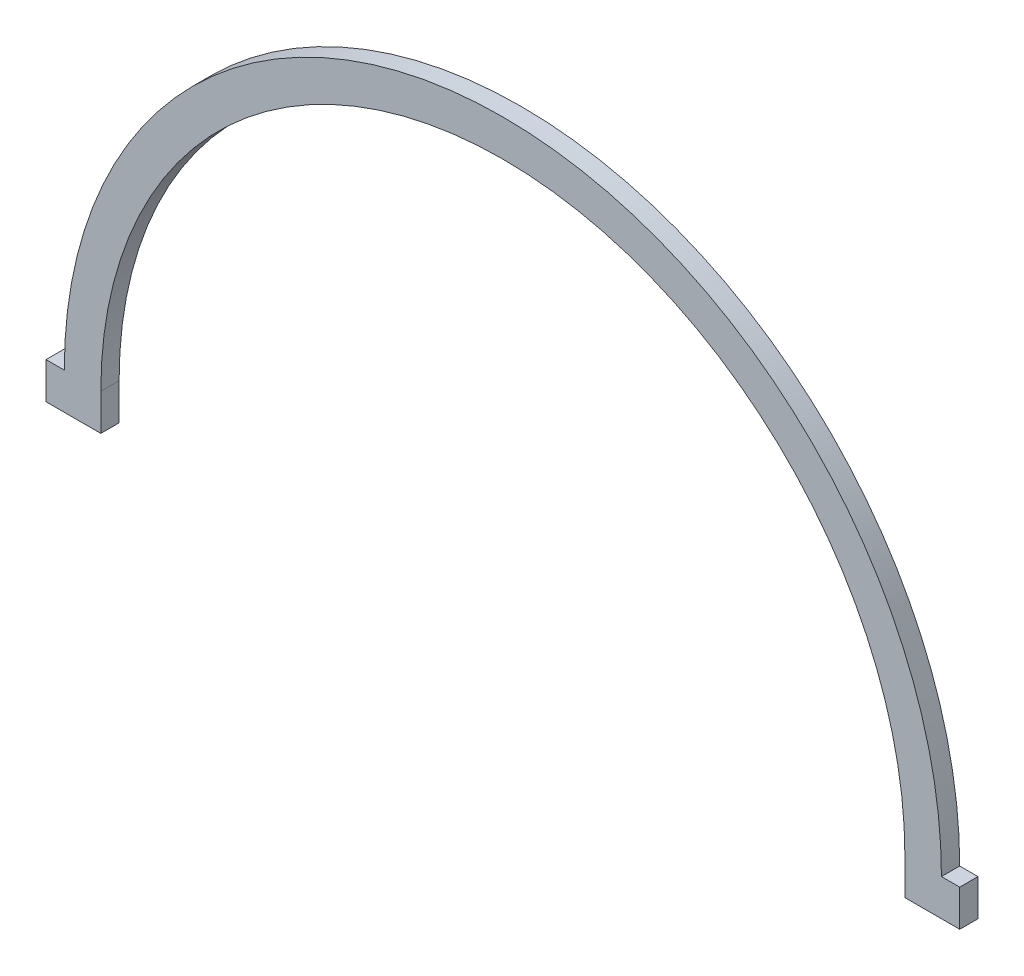
ISO-10303-21;
HEADER;
FILE_DESCRIPTION(('STEP AP214'),'2;1');
FILE_NAME('part.step','',(''),(''),'','','');
FILE_SCHEMA(('AUTOMOTIVE_DESIGN { 1 0 10303 214 1 1 1 1 }'));
ENDSEC;
DATA;
#1=APPLICATION_CONTEXT('core data for automotive mechanical design processes');
#2=APPLICATION_PROTOCOL_DEFINITION('international standard','automotive_design',2000,#1);
#3=PRODUCT_CONTEXT('',#1,'mechanical');
#4=PRODUCT('Part','Part','',(#3));
#5=PRODUCT_RELATED_PRODUCT_CATEGORY('part','',(#4));
#6=PRODUCT_DEFINITION_FORMATION('','',#4);
#7=PRODUCT_DEFINITION_CONTEXT('part definition',#1,'design');
#8=PRODUCT_DEFINITION('design','',#6,#7);
#9=PRODUCT_DEFINITION_SHAPE('','',#8);
#10=(LENGTH_UNIT() NAMED_UNIT(*) SI_UNIT(.MILLI.,.METRE.));
#11=(NAMED_UNIT(*) PLANE_ANGLE_UNIT() SI_UNIT($,.RADIAN.));
#12=(NAMED_UNIT(*) SI_UNIT($,.STERADIAN.) SOLID_ANGLE_UNIT());
#13=UNCERTAINTY_MEASURE_WITH_UNIT(LENGTH_MEASURE(1.E-05),#10,'distance_accuracy_value','');
#14=(GEOMETRIC_REPRESENTATION_CONTEXT(3) GLOBAL_UNCERTAINTY_ASSIGNED_CONTEXT((#13)) GLOBAL_UNIT_ASSIGNED_CONTEXT((#10,
#11,#12)) REPRESENTATION_CONTEXT('',''));
#15=CARTESIAN_POINT('',(0.,0.,0.));
#16=DIRECTION('',(0.,0.,1.));
#17=DIRECTION('',(1.,0.,0.));
#18=AXIS2_PLACEMENT_3D('',#15,#16,#17);
#19=CARTESIAN_POINT('',(-79.375,-6.34999999999999,3.175));
#20=DIRECTION('',(0.,1.,0.));
#21=DIRECTION('',(-1.,0.,0.));
#22=AXIS2_PLACEMENT_3D('',#19,#20,#21);
#23=PLANE('',#22);
#24=DIRECTION('',(1.,0.,0.));
#25=VECTOR('',#24,1.);
#26=CARTESIAN_POINT('',(-79.375,-6.34999999999999,0.));
#27=LINE('',#26,#25);
#28=CARTESIAN_POINT('',(-79.375,-6.34999999999999,0.));
#29=VERTEX_POINT('',#28);
#30=CARTESIAN_POINT('',(-69.85,-6.35000000000001,0.));
#31=VERTEX_POINT('',#30);
#32=EDGE_CURVE('E139',#29,#31,#27,.T.);
#33=ORIENTED_EDGE('',*,*,#32,.T.);
#34=DIRECTION('',(0.,0.,1.));
#35=VECTOR('',#34,1.);
#36=CARTESIAN_POINT('',(-69.85,-6.35000000000001,0.));
#37=LINE('',#36,#35);
#38=CARTESIAN_POINT('',(-69.85,-6.35000000000001,3.175));
#39=VERTEX_POINT('',#38);
#40=EDGE_CURVE('E122',#31,#39,#37,.T.);
#41=ORIENTED_EDGE('',*,*,#40,.T.);
#42=DIRECTION('',(1.,0.,0.));
#43=VECTOR('',#42,1.);
#44=CARTESIAN_POINT('',(-79.375,-6.34999999999999,3.175));
#45=LINE('',#44,#43);
#46=CARTESIAN_POINT('',(-79.375,-6.34999999999999,3.175));
#47=VERTEX_POINT('',#46);
#48=EDGE_CURVE('E183',#47,#39,#45,.T.);
#49=ORIENTED_EDGE('',*,*,#48,.F.);
#50=DIRECTION('',(0.,0.,-1.));
#51=VECTOR('',#50,1.);
#52=CARTESIAN_POINT('',(-79.375,-6.34999999999999,3.175));
#53=LINE('',#52,#51);
#54=EDGE_CURVE('E144',#47,#29,#53,.T.);
#55=ORIENTED_EDGE('',*,*,#54,.T.);
#56=EDGE_LOOP('',(#33,#41,#49,#55));
#57=FACE_BOUND('',#56,.T.);
#58=ADVANCED_FACE('F38',(#57),#23,.F.);
#59=CARTESIAN_POINT('',(0.,0.,3.175));
#60=DIRECTION('',(0.,0.,1.));
#61=DIRECTION('',(1.,0.,0.));
#62=AXIS2_PLACEMENT_3D('',#59,#60,#61);
#63=PLANE('',#62);
#64=DIRECTION('',(0.,-1.,0.));
#65=VECTOR('',#64,1.);
#66=CARTESIAN_POINT('',(-69.85,-4.87759943036386E-13,3.175));
#67=LINE('',#66,#65);
#68=CARTESIAN_POINT('',(-69.85,-4.87759943036386E-13,3.175));
#69=VERTEX_POINT('',#68);
#70=EDGE_CURVE('E128',#69,#39,#67,.T.);
#71=ORIENTED_EDGE('',*,*,#70,.F.);
#72=CARTESIAN_POINT('',(0.,0.,3.175));
#73=DIRECTION('',(0.,0.,1.));
#74=DIRECTION('',(1.,0.,0.));
#75=AXIS2_PLACEMENT_3D('',#72,#73,#74);
#76=CIRCLE('',#75,69.85);
#77=CARTESIAN_POINT('',(69.85,0.,3.175));
#78=VERTEX_POINT('',#77);
#79=EDGE_CURVE('E197',#78,#69,#76,.T.);
#80=ORIENTED_EDGE('',*,*,#79,.F.);
#81=DIRECTION('',(1.,0.,0.));
#82=VECTOR('',#81,1.);
#83=CARTESIAN_POINT('',(-69.85,0.,3.175));
#84=LINE('',#83,#82);
#85=CARTESIAN_POINT('',(69.8324231282597,0.,3.175));
#86=VERTEX_POINT('',#85);
#87=EDGE_CURVE('E195',#86,#78,#84,.T.);
#88=ORIENTED_EDGE('',*,*,#87,.F.);
#89=DIRECTION('',(0.,1.,0.));
#90=VECTOR('',#89,1.);
#91=CARTESIAN_POINT('',(69.8324231282597,-4.87759943036386E-13,3.175));
#92=LINE('',#91,#90);
#93=CARTESIAN_POINT('',(69.8324231282597,-6.35000000000001,3.175));
#94=VERTEX_POINT('',#93);
#95=EDGE_CURVE('E53',#94,#86,#92,.T.);
#96=ORIENTED_EDGE('',*,*,#95,.F.);
#97=CARTESIAN_POINT('',(79.375,-6.35000000000001,3.175));
#98=VERTEX_POINT('',#97);
#99=EDGE_CURVE('E185',#94,#98,#45,.T.);
#100=ORIENTED_EDGE('',*,*,#99,.T.);
#101=DIRECTION('',(0.,1.,0.));
#102=VECTOR('',#101,1.);
#103=CARTESIAN_POINT('',(79.375,0.,3.175));
#104=LINE('',#103,#102);
#105=CARTESIAN_POINT('',(79.375,0.,3.175));
#106=VERTEX_POINT('',#105);
#107=EDGE_CURVE('E181',#98,#106,#104,.T.);
#108=ORIENTED_EDGE('',*,*,#107,.T.);
#109=DIRECTION('',(-1.,0.,0.));
#110=VECTOR('',#109,1.);
#111=CARTESIAN_POINT('',(76.2,0.,3.175));
#112=LINE('',#111,#110);
#113=CARTESIAN_POINT('',(76.2,0.,3.175));
#114=VERTEX_POINT('',#113);
#115=EDGE_CURVE('E160',#106,#114,#112,.T.);
#116=ORIENTED_EDGE('',*,*,#115,.T.);
#117=CARTESIAN_POINT('',(0.,0.,3.175));
#118=DIRECTION('',(0.,0.,1.));
#119=DIRECTION('',(1.,0.,0.));
#120=AXIS2_PLACEMENT_3D('',#117,#118,#119);
#121=CIRCLE('',#120,76.2);
#122=CARTESIAN_POINT('',(-76.2,0.,3.175));
#123=VERTEX_POINT('',#122);
#124=EDGE_CURVE('E155',#114,#123,#121,.T.);
#125=ORIENTED_EDGE('',*,*,#124,.T.);
#126=DIRECTION('',(-1.,0.,0.));
#127=VECTOR('',#126,1.);
#128=CARTESIAN_POINT('',(-79.375,0.,3.175));
#129=LINE('',#128,#127);
#130=CARTESIAN_POINT('',(-79.375,0.,3.175));
#131=VERTEX_POINT('',#130);
#132=EDGE_CURVE('E187',#123,#131,#129,.T.);
#133=ORIENTED_EDGE('',*,*,#132,.T.);
#134=DIRECTION('',(0.,-1.,0.));
#135=VECTOR('',#134,1.);
#136=CARTESIAN_POINT('',(-79.375,0.,3.175));
#137=LINE('',#136,#135);
#138=EDGE_CURVE('E171',#131,#47,#137,.T.);
#139=ORIENTED_EDGE('',*,*,#138,.T.);
#140=ORIENTED_EDGE('',*,*,#48,.T.);
#141=EDGE_LOOP('',(#71,#80,#88,#96,#100,#108,#116,#125,#133,#139,#140));
#142=FACE_BOUND('',#141,.T.);
#143=ADVANCED_FACE('F218',(#142),#63,.T.);
#144=CARTESIAN_POINT('',(0.,0.,0.));
#145=DIRECTION('',(0.,0.,1.));
#146=DIRECTION('',(1.,0.,0.));
#147=AXIS2_PLACEMENT_3D('',#144,#145,#146);
#148=PLANE('',#147);
#149=CARTESIAN_POINT('',(0.,0.,0.));
#150=DIRECTION('',(0.,0.,1.));
#151=DIRECTION('',(1.,0.,0.));
#152=AXIS2_PLACEMENT_3D('',#149,#150,#151);
#153=CIRCLE('',#152,69.85);
#154=CARTESIAN_POINT('',(69.85,0.,0.));
#155=VERTEX_POINT('',#154);
#156=CARTESIAN_POINT('',(-69.85,0.,0.));
#157=VERTEX_POINT('',#156);
#158=EDGE_CURVE('E140',#155,#157,#153,.T.);
#159=ORIENTED_EDGE('',*,*,#158,.T.);
#160=DIRECTION('',(0.,-1.,0.));
#161=VECTOR('',#160,1.);
#162=CARTESIAN_POINT('',(-69.85,-4.87759943036386E-13,0.));
#163=LINE('',#162,#161);
#164=EDGE_CURVE('E125',#157,#31,#163,.T.);
#165=ORIENTED_EDGE('',*,*,#164,.T.);
#166=ORIENTED_EDGE('',*,*,#32,.F.);
#167=DIRECTION('',(0.,-1.,0.));
#168=VECTOR('',#167,1.);
#169=CARTESIAN_POINT('',(-79.375,0.,0.));
#170=LINE('',#169,#168);
#171=CARTESIAN_POINT('',(-79.375,0.,0.));
#172=VERTEX_POINT('',#171);
#173=EDGE_CURVE('E150',#172,#29,#170,.T.);
#174=ORIENTED_EDGE('',*,*,#173,.F.);
#175=DIRECTION('',(-1.,0.,0.));
#176=VECTOR('',#175,1.);
#177=CARTESIAN_POINT('',(-79.375,0.,0.));
#178=LINE('',#177,#176);
#179=CARTESIAN_POINT('',(-76.2,0.,0.));
#180=VERTEX_POINT('',#179);
#181=EDGE_CURVE('E174',#180,#172,#178,.T.);
#182=ORIENTED_EDGE('',*,*,#181,.F.);
#183=CARTESIAN_POINT('',(0.,0.,0.));
#184=DIRECTION('',(0.,0.,1.));
#185=DIRECTION('',(1.,0.,0.));
#186=AXIS2_PLACEMENT_3D('',#183,#184,#185);
#187=CIRCLE('',#186,76.2);
#188=CARTESIAN_POINT('',(76.2,0.,0.));
#189=VERTEX_POINT('',#188);
#190=EDGE_CURVE('E175',#189,#180,#187,.T.);
#191=ORIENTED_EDGE('',*,*,#190,.F.);
#192=DIRECTION('',(-1.,0.,0.));
#193=VECTOR('',#192,1.);
#194=CARTESIAN_POINT('',(76.2,0.,0.));
#195=LINE('',#194,#193);
#196=CARTESIAN_POINT('',(79.375,0.,0.));
#197=VERTEX_POINT('',#196);
#198=EDGE_CURVE('E148',#197,#189,#195,.T.);
#199=ORIENTED_EDGE('',*,*,#198,.F.);
#200=DIRECTION('',(0.,1.,0.));
#201=VECTOR('',#200,1.);
#202=CARTESIAN_POINT('',(79.375,0.,0.));
#203=LINE('',#202,#201);
#204=CARTESIAN_POINT('',(79.375,-6.35000000000001,0.));
#205=VERTEX_POINT('',#204);
#206=EDGE_CURVE('E145',#205,#197,#203,.T.);
#207=ORIENTED_EDGE('',*,*,#206,.F.);
#208=CARTESIAN_POINT('',(69.8324231282597,-6.35000000000001,0.));
#209=VERTEX_POINT('',#208);
#210=EDGE_CURVE('E146',#209,#205,#27,.T.);
#211=ORIENTED_EDGE('',*,*,#210,.F.);
#212=DIRECTION('',(0.,1.,0.));
#213=VECTOR('',#212,1.);
#214=CARTESIAN_POINT('',(69.8324231282597,-4.87759943036386E-13,0.));
#215=LINE('',#214,#213);
#216=CARTESIAN_POINT('',(69.8324231282597,-4.87759943036386E-13,0.));
#217=VERTEX_POINT('',#216);
#218=EDGE_CURVE('E134',#209,#217,#215,.T.);
#219=ORIENTED_EDGE('',*,*,#218,.T.);
#220=DIRECTION('',(1.,0.,0.));
#221=VECTOR('',#220,1.);
#222=CARTESIAN_POINT('',(-69.85,0.,0.));
#223=LINE('',#222,#221);
#224=EDGE_CURVE('E61',#217,#155,#223,.T.);
#225=ORIENTED_EDGE('',*,*,#224,.T.);
#226=EDGE_LOOP('',(#159,#165,#166,#174,#182,#191,#199,#207,#211,#219,#225));
#227=FACE_BOUND('',#226,.T.);
#228=ADVANCED_FACE('F137',(#227),#148,.F.);
#229=CARTESIAN_POINT('',(0.,0.,3.175));
#230=DIRECTION('',(0.,0.,-1.));
#231=DIRECTION('',(-1.,0.,0.));
#232=AXIS2_PLACEMENT_3D('',#229,#230,#231);
#233=CYLINDRICAL_SURFACE('',#232,76.2);
#234=ORIENTED_EDGE('',*,*,#190,.T.);
#235=DIRECTION('',(0.,0.,-1.));
#236=VECTOR('',#235,1.);
#237=CARTESIAN_POINT('',(-76.2,0.,3.175));
#238=LINE('',#237,#236);
#239=EDGE_CURVE('E11',#123,#180,#238,.T.);
#240=ORIENTED_EDGE('',*,*,#239,.F.);
#241=ORIENTED_EDGE('',*,*,#124,.F.);
#242=DIRECTION('',(0.,0.,-1.));
#243=VECTOR('',#242,1.);
#244=CARTESIAN_POINT('',(76.2,0.,3.175));
#245=LINE('',#244,#243);
#246=EDGE_CURVE('E156',#114,#189,#245,.T.);
#247=ORIENTED_EDGE('',*,*,#246,.T.);
#248=EDGE_LOOP('',(#234,#240,#241,#247));
#249=FACE_BOUND('',#248,.T.);
#250=ADVANCED_FACE('F40',(#249),#233,.T.);
#251=CARTESIAN_POINT('',(-79.375,0.,3.175));
#252=DIRECTION('',(0.,-1.,0.));
#253=DIRECTION('',(1.,0.,0.));
#254=AXIS2_PLACEMENT_3D('',#251,#252,#253);
#255=PLANE('',#254);
#256=ORIENTED_EDGE('',*,*,#181,.T.);
#257=DIRECTION('',(0.,0.,-1.));
#258=VECTOR('',#257,1.);
#259=CARTESIAN_POINT('',(-79.375,0.,3.175));
#260=LINE('',#259,#258);
#261=EDGE_CURVE('E46',#131,#172,#260,.T.);
#262=ORIENTED_EDGE('',*,*,#261,.F.);
#263=ORIENTED_EDGE('',*,*,#132,.F.);
#264=ORIENTED_EDGE('',*,*,#239,.T.);
#265=EDGE_LOOP('',(#256,#262,#263,#264));
#266=FACE_BOUND('',#265,.T.);
#267=ADVANCED_FACE('F221',(#266),#255,.F.);
#268=CARTESIAN_POINT('',(-79.375,0.,3.175));
#269=DIRECTION('',(1.,0.,0.));
#270=DIRECTION('',(0.,0.,-1.));
#271=AXIS2_PLACEMENT_3D('',#268,#269,#270);
#272=PLANE('',#271);
#273=ORIENTED_EDGE('',*,*,#173,.T.);
#274=ORIENTED_EDGE('',*,*,#54,.F.);
#275=ORIENTED_EDGE('',*,*,#138,.F.);
#276=ORIENTED_EDGE('',*,*,#261,.T.);
#277=EDGE_LOOP('',(#273,#274,#275,#276));
#278=FACE_BOUND('',#277,.T.);
#279=ADVANCED_FACE('F170',(#278),#272,.F.);
#280=ORIENTED_EDGE('',*,*,#99,.F.);
#281=DIRECTION('',(0.,0.,1.));
#282=VECTOR('',#281,1.);
#283=CARTESIAN_POINT('',(69.8324231282597,-6.35000000000001,0.));
#284=LINE('',#283,#282);
#285=EDGE_CURVE('E133',#209,#94,#284,.T.);
#286=ORIENTED_EDGE('',*,*,#285,.F.);
#287=ORIENTED_EDGE('',*,*,#210,.T.);
#288=DIRECTION('',(0.,0.,-1.));
#289=VECTOR('',#288,1.);
#290=CARTESIAN_POINT('',(79.375,-6.35000000000001,3.175));
#291=LINE('',#290,#289);
#292=EDGE_CURVE('E163',#98,#205,#291,.T.);
#293=ORIENTED_EDGE('',*,*,#292,.F.);
#294=EDGE_LOOP('',(#280,#286,#287,#293));
#295=FACE_BOUND('',#294,.T.);
#296=ADVANCED_FACE('F235',(#295),#23,.F.);
#297=CARTESIAN_POINT('',(79.375,0.,3.175));
#298=DIRECTION('',(-1.,0.,0.));
#299=DIRECTION('',(0.,-1.,0.));
#300=AXIS2_PLACEMENT_3D('',#297,#298,#299);
#301=PLANE('',#300);
#302=ORIENTED_EDGE('',*,*,#206,.T.);
#303=DIRECTION('',(0.,0.,-1.));
#304=VECTOR('',#303,1.);
#305=CARTESIAN_POINT('',(79.375,0.,3.175));
#306=LINE('',#305,#304);
#307=EDGE_CURVE('E159',#106,#197,#306,.T.);
#308=ORIENTED_EDGE('',*,*,#307,.F.);
#309=ORIENTED_EDGE('',*,*,#107,.F.);
#310=ORIENTED_EDGE('',*,*,#292,.T.);
#311=EDGE_LOOP('',(#302,#308,#309,#310));
#312=FACE_BOUND('',#311,.T.);
#313=ADVANCED_FACE('F231',(#312),#301,.F.);
#314=CARTESIAN_POINT('',(76.2,0.,3.175));
#315=DIRECTION('',(0.,-1.,0.));
#316=DIRECTION('',(1.,0.,0.));
#317=AXIS2_PLACEMENT_3D('',#314,#315,#316);
#318=PLANE('',#317);
#319=ORIENTED_EDGE('',*,*,#198,.T.);
#320=ORIENTED_EDGE('',*,*,#246,.F.);
#321=ORIENTED_EDGE('',*,*,#115,.F.);
#322=ORIENTED_EDGE('',*,*,#307,.T.);
#323=EDGE_LOOP('',(#319,#320,#321,#322));
#324=FACE_BOUND('',#323,.T.);
#325=ADVANCED_FACE('F226',(#324),#318,.F.);
#326=CARTESIAN_POINT('',(0.,0.,3.175));
#327=DIRECTION('',(0.,0.,-1.));
#328=DIRECTION('',(-1.,0.,0.));
#329=AXIS2_PLACEMENT_3D('',#326,#327,#328);
#330=CYLINDRICAL_SURFACE('',#329,69.85);
#331=ORIENTED_EDGE('',*,*,#158,.F.);
#332=DIRECTION('',(0.,0.,-1.));
#333=VECTOR('',#332,1.);
#334=CARTESIAN_POINT('',(69.85,0.,3.175));
#335=LINE('',#334,#333);
#336=EDGE_CURVE('E192',#78,#155,#335,.T.);
#337=ORIENTED_EDGE('',*,*,#336,.F.);
#338=ORIENTED_EDGE('',*,*,#79,.T.);
#339=DIRECTION('',(0.,0.,-1.));
#340=VECTOR('',#339,1.);
#341=CARTESIAN_POINT('',(-69.85,0.,3.175));
#342=LINE('',#341,#340);
#343=EDGE_CURVE('E177',#69,#157,#342,.T.);
#344=ORIENTED_EDGE('',*,*,#343,.T.);
#345=EDGE_LOOP('',(#331,#337,#338,#344));
#346=FACE_BOUND('',#345,.T.);
#347=ADVANCED_FACE('F216',(#346),#330,.F.);
#348=CARTESIAN_POINT('',(-69.85,0.,3.175));
#349=DIRECTION('',(0.,1.,0.));
#350=DIRECTION('',(0.,0.,1.));
#351=AXIS2_PLACEMENT_3D('',#348,#349,#350);
#352=PLANE('',#351);
#353=DIRECTION('',(0.,0.,1.));
#354=VECTOR('',#353,1.);
#355=CARTESIAN_POINT('',(69.8324231282597,-4.87759943036386E-13,0.));
#356=LINE('',#355,#354);
#357=EDGE_CURVE('E199',#217,#86,#356,.T.);
#358=ORIENTED_EDGE('',*,*,#357,.T.);
#359=ORIENTED_EDGE('',*,*,#87,.T.);
#360=ORIENTED_EDGE('',*,*,#336,.T.);
#361=ORIENTED_EDGE('',*,*,#224,.F.);
#362=EDGE_LOOP('',(#358,#359,#360,#361));
#363=FACE_BOUND('',#362,.T.);
#364=ADVANCED_FACE('F211',(#363),#352,.T.);
#365=CARTESIAN_POINT('',(69.8324231282597,-4.87759943036386E-13,0.));
#366=DIRECTION('',(1.,0.,0.));
#367=DIRECTION('',(0.,0.,-1.));
#368=AXIS2_PLACEMENT_3D('',#365,#366,#367);
#369=PLANE('',#368);
#370=ORIENTED_EDGE('',*,*,#95,.T.);
#371=ORIENTED_EDGE('',*,*,#357,.F.);
#372=ORIENTED_EDGE('',*,*,#218,.F.);
#373=ORIENTED_EDGE('',*,*,#285,.T.);
#374=EDGE_LOOP('',(#370,#371,#372,#373));
#375=FACE_BOUND('',#374,.T.);
#376=ADVANCED_FACE('F236',(#375),#369,.F.);
#377=CARTESIAN_POINT('',(-69.85,-4.87759943036386E-13,0.));
#378=DIRECTION('',(-1.,0.,0.));
#379=DIRECTION('',(0.,0.,1.));
#380=AXIS2_PLACEMENT_3D('',#377,#378,#379);
#381=PLANE('',#380);
#382=ORIENTED_EDGE('',*,*,#70,.T.);
#383=ORIENTED_EDGE('',*,*,#40,.F.);
#384=ORIENTED_EDGE('',*,*,#164,.F.);
#385=ORIENTED_EDGE('',*,*,#343,.F.);
#386=EDGE_LOOP('',(#382,#383,#384,#385));
#387=FACE_BOUND('',#386,.T.);
#388=ADVANCED_FACE('F124',(#387),#381,.F.);
#389=CLOSED_SHELL('',(#58,#143,#228,#250,#267,#279,#296,#313,#325,#347,#364,#376,#388));
#390=MANIFOLD_SOLID_BREP('B2',#389);
#391=ADVANCED_BREP_SHAPE_REPRESENTATION('',(#18,#390),#14);
#392=SHAPE_DEFINITION_REPRESENTATION(#9,#391);
ENDSEC;
END-ISO-10303-21;
